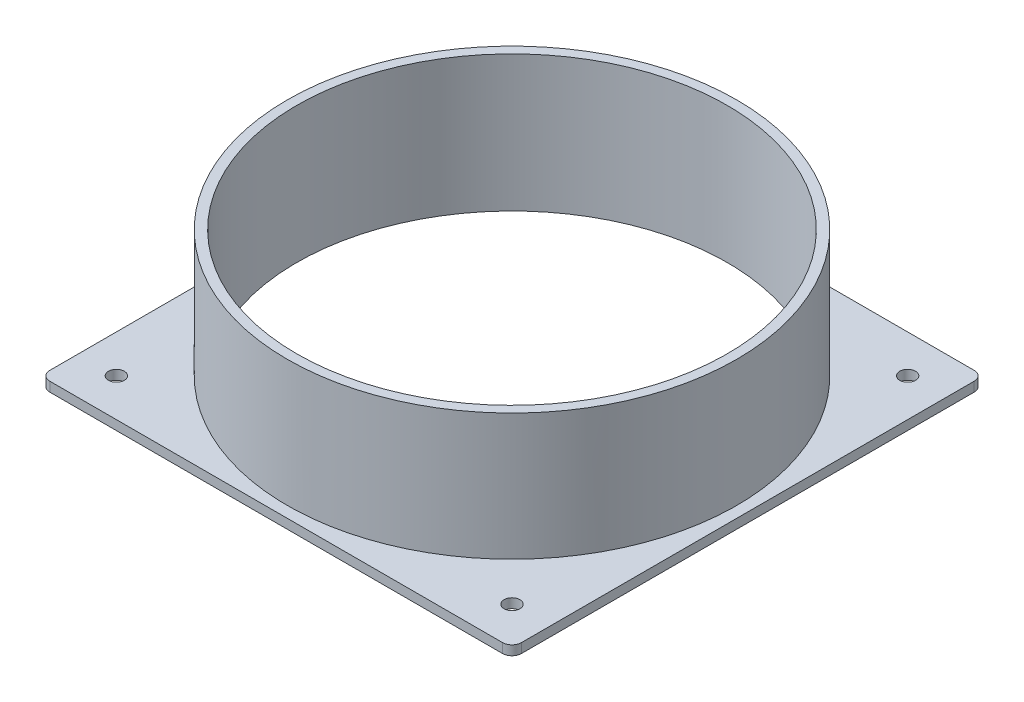
ISO-10303-21;
HEADER;
FILE_DESCRIPTION(('STEP AP214'),'2;1');
FILE_NAME('part.step','',(''),(''),'','','');
FILE_SCHEMA(('AUTOMOTIVE_DESIGN { 1 0 10303 214 1 1 1 1 }'));
ENDSEC;
DATA;
#1=APPLICATION_CONTEXT('core data for automotive mechanical design processes');
#2=APPLICATION_PROTOCOL_DEFINITION('international standard','automotive_design',2000,#1);
#3=PRODUCT_CONTEXT('',#1,'mechanical');
#4=PRODUCT('Part','Part','',(#3));
#5=PRODUCT_RELATED_PRODUCT_CATEGORY('part','',(#4));
#6=PRODUCT_DEFINITION_FORMATION('','',#4);
#7=PRODUCT_DEFINITION_CONTEXT('part definition',#1,'design');
#8=PRODUCT_DEFINITION('design','',#6,#7);
#9=PRODUCT_DEFINITION_SHAPE('','',#8);
#10=(LENGTH_UNIT() NAMED_UNIT(*) SI_UNIT(.MILLI.,.METRE.));
#11=(NAMED_UNIT(*) PLANE_ANGLE_UNIT() SI_UNIT($,.RADIAN.));
#12=(NAMED_UNIT(*) SI_UNIT($,.STERADIAN.) SOLID_ANGLE_UNIT());
#13=UNCERTAINTY_MEASURE_WITH_UNIT(LENGTH_MEASURE(1.E-05),#10,'distance_accuracy_value','');
#14=(GEOMETRIC_REPRESENTATION_CONTEXT(3) GLOBAL_UNCERTAINTY_ASSIGNED_CONTEXT((#13)) GLOBAL_UNIT_ASSIGNED_CONTEXT((#10,
#11,#12)) REPRESENTATION_CONTEXT('',''));
#15=CARTESIAN_POINT('',(0.,0.,0.));
#16=DIRECTION('',(0.,0.,1.));
#17=DIRECTION('',(1.,0.,0.));
#18=AXIS2_PLACEMENT_3D('',#15,#16,#17);
#19=CARTESIAN_POINT('',(-71.5,3.,71.5));
#20=DIRECTION('',(0.,-1.,0.));
#21=DIRECTION('',(0.,0.,-1.));
#22=AXIS2_PLACEMENT_3D('',#19,#20,#21);
#23=PLANE('',#22);
#24=CARTESIAN_POINT('',(-62.5000000000007,3.,62.4999999999994));
#25=DIRECTION('',(0.,1.,0.));
#26=DIRECTION('',(0.,0.,1.));
#27=AXIS2_PLACEMENT_3D('',#24,#25,#26);
#28=CIRCLE('',#27,2.5);
#29=CARTESIAN_POINT('',(-62.5000000000007,3.,64.9999999999993));
#30=VERTEX_POINT('',#29);
#31=EDGE_CURVE('E208',#30,#30,#28,.T.);
#32=ORIENTED_EDGE('',*,*,#31,.F.);
#33=EDGE_LOOP('',(#32));
#34=FACE_BOUND('',#33,.T.);
#35=CARTESIAN_POINT('',(62.4999999999996,3.,62.5000000000004));
#36=DIRECTION('',(0.,1.,0.));
#37=DIRECTION('',(0.,0.,1.));
#38=AXIS2_PLACEMENT_3D('',#35,#36,#37);
#39=CIRCLE('',#38,2.50000000000001);
#40=CARTESIAN_POINT('',(62.4999999999996,3.,65.0000000000004));
#41=VERTEX_POINT('',#40);
#42=EDGE_CURVE('E202',#41,#41,#39,.T.);
#43=ORIENTED_EDGE('',*,*,#42,.F.);
#44=EDGE_LOOP('',(#43));
#45=FACE_BOUND('',#44,.T.);
#46=CARTESIAN_POINT('',(62.5000000000002,3.,-62.4999999999998));
#47=DIRECTION('',(0.,1.,0.));
#48=DIRECTION('',(0.,0.,1.));
#49=AXIS2_PLACEMENT_3D('',#46,#47,#48);
#50=CIRCLE('',#49,2.50000000000001);
#51=CARTESIAN_POINT('',(62.5000000000002,3.,-59.9999999999998));
#52=VERTEX_POINT('',#51);
#53=EDGE_CURVE('E196',#52,#52,#50,.T.);
#54=ORIENTED_EDGE('',*,*,#53,.F.);
#55=EDGE_LOOP('',(#54));
#56=FACE_BOUND('',#55,.T.);
#57=CARTESIAN_POINT('',(-62.5,3.,-62.5));
#58=DIRECTION('',(0.,1.,0.));
#59=DIRECTION('',(0.,0.,1.));
#60=AXIS2_PLACEMENT_3D('',#57,#58,#59);
#61=CIRCLE('',#60,2.5);
#62=CARTESIAN_POINT('',(-62.5,3.,-60.));
#63=VERTEX_POINT('',#62);
#64=EDGE_CURVE('E192',#63,#63,#61,.T.);
#65=ORIENTED_EDGE('',*,*,#64,.F.);
#66=EDGE_LOOP('',(#65));
#67=FACE_BOUND('',#66,.T.);
#68=CARTESIAN_POINT('',(-71.5,3.,71.5));
#69=DIRECTION('',(0.,1.,0.));
#70=DIRECTION('',(0.,0.,-1.));
#71=AXIS2_PLACEMENT_3D('',#68,#69,#70);
#72=CIRCLE('',#71,3.);
#73=CARTESIAN_POINT('',(-74.5,3.,71.5));
#74=VERTEX_POINT('',#73);
#75=CARTESIAN_POINT('',(-71.5,3.,74.5));
#76=VERTEX_POINT('',#75);
#77=EDGE_CURVE('E152',#74,#76,#72,.T.);
#78=ORIENTED_EDGE('',*,*,#77,.T.);
#79=DIRECTION('',(1.,0.,0.));
#80=VECTOR('',#79,1.);
#81=CARTESIAN_POINT('',(-71.5,3.,74.5));
#82=LINE('',#81,#80);
#83=CARTESIAN_POINT('',(71.5,3.,74.5));
#84=VERTEX_POINT('',#83);
#85=EDGE_CURVE('E100',#76,#84,#82,.T.);
#86=ORIENTED_EDGE('',*,*,#85,.T.);
#87=CARTESIAN_POINT('',(71.5,3.,71.5));
#88=DIRECTION('',(0.,1.,0.));
#89=DIRECTION('',(0.,0.,1.));
#90=AXIS2_PLACEMENT_3D('',#87,#88,#89);
#91=CIRCLE('',#90,3.);
#92=CARTESIAN_POINT('',(74.5,3.,71.5));
#93=VERTEX_POINT('',#92);
#94=EDGE_CURVE('E184',#84,#93,#91,.T.);
#95=ORIENTED_EDGE('',*,*,#94,.T.);
#96=DIRECTION('',(0.,0.,-1.));
#97=VECTOR('',#96,1.);
#98=CARTESIAN_POINT('',(74.5,3.,-71.5));
#99=LINE('',#98,#97);
#100=CARTESIAN_POINT('',(74.5,3.,-71.5));
#101=VERTEX_POINT('',#100);
#102=EDGE_CURVE('E183',#93,#101,#99,.T.);
#103=ORIENTED_EDGE('',*,*,#102,.T.);
#104=CARTESIAN_POINT('',(71.5,3.,-71.5));
#105=DIRECTION('',(0.,1.,0.));
#106=DIRECTION('',(0.,0.,1.));
#107=AXIS2_PLACEMENT_3D('',#104,#105,#106);
#108=CIRCLE('',#107,3.);
#109=CARTESIAN_POINT('',(71.5,3.,-74.5));
#110=VERTEX_POINT('',#109);
#111=EDGE_CURVE('E119',#101,#110,#108,.T.);
#112=ORIENTED_EDGE('',*,*,#111,.T.);
#113=DIRECTION('',(-1.,0.,0.));
#114=VECTOR('',#113,1.);
#115=CARTESIAN_POINT('',(-71.5,3.,-74.5));
#116=LINE('',#115,#114);
#117=CARTESIAN_POINT('',(-71.5,3.,-74.5));
#118=VERTEX_POINT('',#117);
#119=EDGE_CURVE('E113',#110,#118,#116,.T.);
#120=ORIENTED_EDGE('',*,*,#119,.T.);
#121=CARTESIAN_POINT('',(-71.5,3.,-71.5));
#122=DIRECTION('',(0.,1.,0.));
#123=DIRECTION('',(0.,0.,1.));
#124=AXIS2_PLACEMENT_3D('',#121,#122,#123);
#125=CIRCLE('',#124,3.);
#126=CARTESIAN_POINT('',(-74.5,3.,-71.5));
#127=VERTEX_POINT('',#126);
#128=EDGE_CURVE('E117',#118,#127,#125,.T.);
#129=ORIENTED_EDGE('',*,*,#128,.T.);
#130=DIRECTION('',(0.,0.,1.));
#131=VECTOR('',#130,1.);
#132=CARTESIAN_POINT('',(-74.5,3.,-71.5));
#133=LINE('',#132,#131);
#134=EDGE_CURVE('E56',#127,#74,#133,.T.);
#135=ORIENTED_EDGE('',*,*,#134,.T.);
#136=EDGE_LOOP('',(#78,#86,#95,#103,#112,#120,#129,#135));
#137=FACE_BOUND('',#136,.T.);
#138=CARTESIAN_POINT('',(0.,3.,0.));
#139=DIRECTION('',(0.,-1.,0.));
#140=DIRECTION('',(0.,0.,-1.));
#141=AXIS2_PLACEMENT_3D('',#138,#139,#140);
#142=CIRCLE('',#141,71.);
#143=CARTESIAN_POINT('',(0.,3.,-71.));
#144=VERTEX_POINT('',#143);
#145=EDGE_CURVE('E11',#144,#144,#142,.F.);
#146=ORIENTED_EDGE('',*,*,#145,.F.);
#147=EDGE_LOOP('',(#146));
#148=FACE_BOUND('',#147,.T.);
#149=ADVANCED_FACE('F39',(#34,#45,#56,#67,#137,#148),#23,.F.);
#150=CARTESIAN_POINT('',(-71.5,0.,71.5));
#151=DIRECTION('',(0.,-1.,0.));
#152=DIRECTION('',(0.,0.,-1.));
#153=AXIS2_PLACEMENT_3D('',#150,#151,#152);
#154=PLANE('',#153);
#155=CARTESIAN_POINT('',(62.4999999999996,0.,62.5000000000004));
#156=DIRECTION('',(0.,1.,0.));
#157=DIRECTION('',(0.,0.,1.));
#158=AXIS2_PLACEMENT_3D('',#155,#156,#157);
#159=CIRCLE('',#158,2.50000000000001);
#160=CARTESIAN_POINT('',(62.4999999999996,0.,65.0000000000004));
#161=VERTEX_POINT('',#160);
#162=EDGE_CURVE('E205',#161,#161,#159,.T.);
#163=ORIENTED_EDGE('',*,*,#162,.T.);
#164=EDGE_LOOP('',(#163));
#165=FACE_BOUND('',#164,.T.);
#166=CARTESIAN_POINT('',(-62.5,0.,-62.5));
#167=DIRECTION('',(0.,1.,0.));
#168=DIRECTION('',(0.,0.,1.));
#169=AXIS2_PLACEMENT_3D('',#166,#167,#168);
#170=CIRCLE('',#169,2.5);
#171=CARTESIAN_POINT('',(-62.5,0.,-60.));
#172=VERTEX_POINT('',#171);
#173=EDGE_CURVE('E193',#172,#172,#170,.T.);
#174=ORIENTED_EDGE('',*,*,#173,.T.);
#175=EDGE_LOOP('',(#174));
#176=FACE_BOUND('',#175,.T.);
#177=CARTESIAN_POINT('',(-71.5,0.,71.5));
#178=DIRECTION('',(0.,1.,0.));
#179=DIRECTION('',(0.,0.,-1.));
#180=AXIS2_PLACEMENT_3D('',#177,#178,#179);
#181=CIRCLE('',#180,3.);
#182=CARTESIAN_POINT('',(-74.5,0.,71.5));
#183=VERTEX_POINT('',#182);
#184=CARTESIAN_POINT('',(-71.5,0.,74.5));
#185=VERTEX_POINT('',#184);
#186=EDGE_CURVE('E137',#183,#185,#181,.T.);
#187=ORIENTED_EDGE('',*,*,#186,.F.);
#188=DIRECTION('',(0.,0.,1.));
#189=VECTOR('',#188,1.);
#190=CARTESIAN_POINT('',(-74.5,0.,-71.5));
#191=LINE('',#190,#189);
#192=CARTESIAN_POINT('',(-74.5,0.,-71.5));
#193=VERTEX_POINT('',#192);
#194=EDGE_CURVE('E91',#193,#183,#191,.T.);
#195=ORIENTED_EDGE('',*,*,#194,.F.);
#196=CARTESIAN_POINT('',(-71.5,0.,-71.5));
#197=DIRECTION('',(0.,1.,0.));
#198=DIRECTION('',(0.,0.,1.));
#199=AXIS2_PLACEMENT_3D('',#196,#197,#198);
#200=CIRCLE('',#199,3.);
#201=CARTESIAN_POINT('',(-71.5,0.,-74.5));
#202=VERTEX_POINT('',#201);
#203=EDGE_CURVE('E85',#202,#193,#200,.T.);
#204=ORIENTED_EDGE('',*,*,#203,.F.);
#205=DIRECTION('',(-1.,0.,0.));
#206=VECTOR('',#205,1.);
#207=CARTESIAN_POINT('',(-71.5,0.,-74.5));
#208=LINE('',#207,#206);
#209=CARTESIAN_POINT('',(71.5,0.,-74.5));
#210=VERTEX_POINT('',#209);
#211=EDGE_CURVE('E127',#210,#202,#208,.T.);
#212=ORIENTED_EDGE('',*,*,#211,.F.);
#213=CARTESIAN_POINT('',(71.5,0.,-71.5));
#214=DIRECTION('',(0.,1.,0.));
#215=DIRECTION('',(0.,0.,1.));
#216=AXIS2_PLACEMENT_3D('',#213,#214,#215);
#217=CIRCLE('',#216,3.);
#218=CARTESIAN_POINT('',(74.5,0.,-71.5));
#219=VERTEX_POINT('',#218);
#220=EDGE_CURVE('E147',#219,#210,#217,.T.);
#221=ORIENTED_EDGE('',*,*,#220,.F.);
#222=DIRECTION('',(0.,0.,-1.));
#223=VECTOR('',#222,1.);
#224=CARTESIAN_POINT('',(74.5,0.,-71.5));
#225=LINE('',#224,#223);
#226=CARTESIAN_POINT('',(74.5,0.,71.5));
#227=VERTEX_POINT('',#226);
#228=EDGE_CURVE('E145',#227,#219,#225,.T.);
#229=ORIENTED_EDGE('',*,*,#228,.F.);
#230=CARTESIAN_POINT('',(71.5,0.,71.5));
#231=DIRECTION('',(0.,1.,0.));
#232=DIRECTION('',(0.,0.,1.));
#233=AXIS2_PLACEMENT_3D('',#230,#231,#232);
#234=CIRCLE('',#233,3.);
#235=CARTESIAN_POINT('',(71.5,0.,74.5));
#236=VERTEX_POINT('',#235);
#237=EDGE_CURVE('E143',#236,#227,#234,.T.);
#238=ORIENTED_EDGE('',*,*,#237,.F.);
#239=DIRECTION('',(1.,0.,0.));
#240=VECTOR('',#239,1.);
#241=CARTESIAN_POINT('',(-71.5,0.,74.5));
#242=LINE('',#241,#240);
#243=EDGE_CURVE('E140',#185,#236,#242,.T.);
#244=ORIENTED_EDGE('',*,*,#243,.F.);
#245=EDGE_LOOP('',(#187,#195,#204,#212,#221,#229,#238,#244));
#246=FACE_BOUND('',#245,.T.);
#247=CARTESIAN_POINT('',(0.,0.,0.));
#248=DIRECTION('',(0.,1.,0.));
#249=DIRECTION('',(0.,0.,1.));
#250=AXIS2_PLACEMENT_3D('',#247,#248,#249);
#251=CIRCLE('',#250,68.);
#252=CARTESIAN_POINT('',(0.,0.,68.));
#253=VERTEX_POINT('',#252);
#254=EDGE_CURVE('E141',#253,#253,#251,.T.);
#255=ORIENTED_EDGE('',*,*,#254,.T.);
#256=EDGE_LOOP('',(#255));
#257=FACE_BOUND('',#256,.T.);
#258=CARTESIAN_POINT('',(62.5000000000002,0.,-62.4999999999998));
#259=DIRECTION('',(0.,1.,0.));
#260=DIRECTION('',(0.,0.,1.));
#261=AXIS2_PLACEMENT_3D('',#258,#259,#260);
#262=CIRCLE('',#261,2.50000000000001);
#263=CARTESIAN_POINT('',(62.5000000000002,0.,-59.9999999999998));
#264=VERTEX_POINT('',#263);
#265=EDGE_CURVE('E199',#264,#264,#262,.T.);
#266=ORIENTED_EDGE('',*,*,#265,.T.);
#267=EDGE_LOOP('',(#266));
#268=FACE_BOUND('',#267,.T.);
#269=CARTESIAN_POINT('',(-62.5000000000007,0.,62.4999999999994));
#270=DIRECTION('',(0.,1.,0.));
#271=DIRECTION('',(0.,0.,1.));
#272=AXIS2_PLACEMENT_3D('',#269,#270,#271);
#273=CIRCLE('',#272,2.5);
#274=CARTESIAN_POINT('',(-62.5000000000007,0.,64.9999999999993));
#275=VERTEX_POINT('',#274);
#276=EDGE_CURVE('E211',#275,#275,#273,.T.);
#277=ORIENTED_EDGE('',*,*,#276,.T.);
#278=EDGE_LOOP('',(#277));
#279=FACE_BOUND('',#278,.T.);
#280=ADVANCED_FACE('F170',(#165,#176,#246,#257,#268,#279),#154,.T.);
#281=CARTESIAN_POINT('',(-71.5,3.,71.5));
#282=DIRECTION('',(0.,-1.,0.));
#283=DIRECTION('',(0.,0.,-1.));
#284=AXIS2_PLACEMENT_3D('',#281,#282,#283);
#285=CYLINDRICAL_SURFACE('',#284,3.);
#286=ORIENTED_EDGE('',*,*,#186,.T.);
#287=DIRECTION('',(0.,-1.,0.));
#288=VECTOR('',#287,1.);
#289=CARTESIAN_POINT('',(-71.5,3.,74.5));
#290=LINE('',#289,#288);
#291=EDGE_CURVE('E48',#76,#185,#290,.T.);
#292=ORIENTED_EDGE('',*,*,#291,.F.);
#293=ORIENTED_EDGE('',*,*,#77,.F.);
#294=DIRECTION('',(0.,-1.,0.));
#295=VECTOR('',#294,1.);
#296=CARTESIAN_POINT('',(-74.5,3.,71.5));
#297=LINE('',#296,#295);
#298=EDGE_CURVE('E133',#74,#183,#297,.T.);
#299=ORIENTED_EDGE('',*,*,#298,.T.);
#300=EDGE_LOOP('',(#286,#292,#293,#299));
#301=FACE_BOUND('',#300,.T.);
#302=ADVANCED_FACE('F41',(#301),#285,.T.);
#303=CARTESIAN_POINT('',(-71.5,3.,74.5));
#304=DIRECTION('',(0.,0.,-1.));
#305=DIRECTION('',(-1.,0.,0.));
#306=AXIS2_PLACEMENT_3D('',#303,#304,#305);
#307=PLANE('',#306);
#308=ORIENTED_EDGE('',*,*,#243,.T.);
#309=DIRECTION('',(0.,-1.,0.));
#310=VECTOR('',#309,1.);
#311=CARTESIAN_POINT('',(71.5,3.,74.5));
#312=LINE('',#311,#310);
#313=EDGE_CURVE('E162',#84,#236,#312,.T.);
#314=ORIENTED_EDGE('',*,*,#313,.F.);
#315=ORIENTED_EDGE('',*,*,#85,.F.);
#316=ORIENTED_EDGE('',*,*,#291,.T.);
#317=EDGE_LOOP('',(#308,#314,#315,#316));
#318=FACE_BOUND('',#317,.T.);
#319=ADVANCED_FACE('F165',(#318),#307,.F.);
#320=CARTESIAN_POINT('',(71.5,3.,71.5));
#321=DIRECTION('',(0.,-1.,0.));
#322=DIRECTION('',(0.,0.,-1.));
#323=AXIS2_PLACEMENT_3D('',#320,#321,#322);
#324=CYLINDRICAL_SURFACE('',#323,3.);
#325=ORIENTED_EDGE('',*,*,#237,.T.);
#326=DIRECTION('',(0.,-1.,0.));
#327=VECTOR('',#326,1.);
#328=CARTESIAN_POINT('',(74.5,3.,71.5));
#329=LINE('',#328,#327);
#330=EDGE_CURVE('E159',#93,#227,#329,.T.);
#331=ORIENTED_EDGE('',*,*,#330,.F.);
#332=ORIENTED_EDGE('',*,*,#94,.F.);
#333=ORIENTED_EDGE('',*,*,#313,.T.);
#334=EDGE_LOOP('',(#325,#331,#332,#333));
#335=FACE_BOUND('',#334,.T.);
#336=ADVANCED_FACE('F177',(#335),#324,.T.);
#337=CARTESIAN_POINT('',(74.5,3.,-71.5));
#338=DIRECTION('',(-1.,0.,0.));
#339=DIRECTION('',(0.,0.,1.));
#340=AXIS2_PLACEMENT_3D('',#337,#338,#339);
#341=PLANE('',#340);
#342=ORIENTED_EDGE('',*,*,#228,.T.);
#343=DIRECTION('',(0.,-1.,0.));
#344=VECTOR('',#343,1.);
#345=CARTESIAN_POINT('',(74.5,3.,-71.5));
#346=LINE('',#345,#344);
#347=EDGE_CURVE('E156',#101,#219,#346,.T.);
#348=ORIENTED_EDGE('',*,*,#347,.F.);
#349=ORIENTED_EDGE('',*,*,#102,.F.);
#350=ORIENTED_EDGE('',*,*,#330,.T.);
#351=EDGE_LOOP('',(#342,#348,#349,#350));
#352=FACE_BOUND('',#351,.T.);
#353=ADVANCED_FACE('F181',(#352),#341,.F.);
#354=CARTESIAN_POINT('',(71.5,3.,-71.5));
#355=DIRECTION('',(0.,-1.,0.));
#356=DIRECTION('',(0.,0.,-1.));
#357=AXIS2_PLACEMENT_3D('',#354,#355,#356);
#358=CYLINDRICAL_SURFACE('',#357,3.);
#359=ORIENTED_EDGE('',*,*,#220,.T.);
#360=DIRECTION('',(0.,-1.,0.));
#361=VECTOR('',#360,1.);
#362=CARTESIAN_POINT('',(71.5,3.,-74.5));
#363=LINE('',#362,#361);
#364=EDGE_CURVE('E128',#110,#210,#363,.T.);
#365=ORIENTED_EDGE('',*,*,#364,.F.);
#366=ORIENTED_EDGE('',*,*,#111,.F.);
#367=ORIENTED_EDGE('',*,*,#347,.T.);
#368=EDGE_LOOP('',(#359,#365,#366,#367));
#369=FACE_BOUND('',#368,.T.);
#370=ADVANCED_FACE('F261',(#369),#358,.T.);
#371=CARTESIAN_POINT('',(-71.5,3.,-74.5));
#372=DIRECTION('',(0.,0.,1.));
#373=DIRECTION('',(1.,0.,0.));
#374=AXIS2_PLACEMENT_3D('',#371,#372,#373);
#375=PLANE('',#374);
#376=ORIENTED_EDGE('',*,*,#211,.T.);
#377=DIRECTION('',(0.,-1.,0.));
#378=VECTOR('',#377,1.);
#379=CARTESIAN_POINT('',(-71.5,3.,-74.5));
#380=LINE('',#379,#378);
#381=EDGE_CURVE('E124',#118,#202,#380,.T.);
#382=ORIENTED_EDGE('',*,*,#381,.F.);
#383=ORIENTED_EDGE('',*,*,#119,.F.);
#384=ORIENTED_EDGE('',*,*,#364,.T.);
#385=EDGE_LOOP('',(#376,#382,#383,#384));
#386=FACE_BOUND('',#385,.T.);
#387=ADVANCED_FACE('F125',(#386),#375,.F.);
#388=CARTESIAN_POINT('',(-71.5,3.,-71.5));
#389=DIRECTION('',(0.,-1.,0.));
#390=DIRECTION('',(0.,0.,-1.));
#391=AXIS2_PLACEMENT_3D('',#388,#389,#390);
#392=CYLINDRICAL_SURFACE('',#391,3.);
#393=ORIENTED_EDGE('',*,*,#203,.T.);
#394=DIRECTION('',(0.,-1.,0.));
#395=VECTOR('',#394,1.);
#396=CARTESIAN_POINT('',(-74.5,3.,-71.5));
#397=LINE('',#396,#395);
#398=EDGE_CURVE('E129',#127,#193,#397,.T.);
#399=ORIENTED_EDGE('',*,*,#398,.F.);
#400=ORIENTED_EDGE('',*,*,#128,.F.);
#401=ORIENTED_EDGE('',*,*,#381,.T.);
#402=EDGE_LOOP('',(#393,#399,#400,#401));
#403=FACE_BOUND('',#402,.T.);
#404=ADVANCED_FACE('F131',(#403),#392,.T.);
#405=CARTESIAN_POINT('',(-74.5,3.,-71.5));
#406=DIRECTION('',(1.,0.,0.));
#407=DIRECTION('',(0.,0.,-1.));
#408=AXIS2_PLACEMENT_3D('',#405,#406,#407);
#409=PLANE('',#408);
#410=ORIENTED_EDGE('',*,*,#194,.T.);
#411=ORIENTED_EDGE('',*,*,#298,.F.);
#412=ORIENTED_EDGE('',*,*,#134,.F.);
#413=ORIENTED_EDGE('',*,*,#398,.T.);
#414=EDGE_LOOP('',(#410,#411,#412,#413));
#415=FACE_BOUND('',#414,.T.);
#416=ADVANCED_FACE('F254',(#415),#409,.F.);
#417=CARTESIAN_POINT('',(0.,3.,0.));
#418=DIRECTION('',(0.,-1.,0.));
#419=DIRECTION('',(0.,0.,-1.));
#420=AXIS2_PLACEMENT_3D('',#417,#418,#419);
#421=CYLINDRICAL_SURFACE('',#420,68.);
#422=ORIENTED_EDGE('',*,*,#254,.F.);
#423=EDGE_LOOP('',(#422));
#424=FACE_BOUND('',#423,.T.);
#425=CARTESIAN_POINT('',(0.,43.,0.));
#426=DIRECTION('',(0.,1.,0.));
#427=DIRECTION('',(0.,0.,1.));
#428=AXIS2_PLACEMENT_3D('',#425,#426,#427);
#429=CIRCLE('',#428,68.);
#430=CARTESIAN_POINT('',(0.,43.,68.));
#431=VERTEX_POINT('',#430);
#432=EDGE_CURVE('E219',#431,#431,#429,.T.);
#433=ORIENTED_EDGE('',*,*,#432,.T.);
#434=EDGE_LOOP('',(#433));
#435=FACE_BOUND('',#434,.T.);
#436=ADVANCED_FACE('F223',(#424,#435),#421,.F.);
#437=CARTESIAN_POINT('',(-62.5,3.,-62.5));
#438=DIRECTION('',(0.,-1.,0.));
#439=DIRECTION('',(0.,0.,-1.));
#440=AXIS2_PLACEMENT_3D('',#437,#438,#439);
#441=CYLINDRICAL_SURFACE('',#440,2.5);
#442=ORIENTED_EDGE('',*,*,#64,.T.);
#443=EDGE_LOOP('',(#442));
#444=FACE_BOUND('',#443,.T.);
#445=ORIENTED_EDGE('',*,*,#173,.F.);
#446=EDGE_LOOP('',(#445));
#447=FACE_BOUND('',#446,.T.);
#448=ADVANCED_FACE('F322',(#444,#447),#441,.F.);
#449=CARTESIAN_POINT('',(62.5000000000002,3.,-62.4999999999998));
#450=DIRECTION('',(0.,-1.,0.));
#451=DIRECTION('',(0.,0.,-1.));
#452=AXIS2_PLACEMENT_3D('',#449,#450,#451);
#453=CYLINDRICAL_SURFACE('',#452,2.50000000000001);
#454=ORIENTED_EDGE('',*,*,#53,.T.);
#455=EDGE_LOOP('',(#454));
#456=FACE_BOUND('',#455,.T.);
#457=ORIENTED_EDGE('',*,*,#265,.F.);
#458=EDGE_LOOP('',(#457));
#459=FACE_BOUND('',#458,.T.);
#460=ADVANCED_FACE('F331',(#456,#459),#453,.F.);
#461=CARTESIAN_POINT('',(62.4999999999996,3.,62.5000000000004));
#462=DIRECTION('',(0.,-1.,0.));
#463=DIRECTION('',(0.,0.,-1.));
#464=AXIS2_PLACEMENT_3D('',#461,#462,#463);
#465=CYLINDRICAL_SURFACE('',#464,2.50000000000001);
#466=ORIENTED_EDGE('',*,*,#42,.T.);
#467=EDGE_LOOP('',(#466));
#468=FACE_BOUND('',#467,.T.);
#469=ORIENTED_EDGE('',*,*,#162,.F.);
#470=EDGE_LOOP('',(#469));
#471=FACE_BOUND('',#470,.T.);
#472=ADVANCED_FACE('F238',(#468,#471),#465,.F.);
#473=CARTESIAN_POINT('',(-62.5000000000007,3.,62.4999999999994));
#474=DIRECTION('',(0.,-1.,0.));
#475=DIRECTION('',(0.,0.,-1.));
#476=AXIS2_PLACEMENT_3D('',#473,#474,#475);
#477=CYLINDRICAL_SURFACE('',#476,2.5);
#478=ORIENTED_EDGE('',*,*,#31,.T.);
#479=EDGE_LOOP('',(#478));
#480=FACE_BOUND('',#479,.T.);
#481=ORIENTED_EDGE('',*,*,#276,.F.);
#482=EDGE_LOOP('',(#481));
#483=FACE_BOUND('',#482,.T.);
#484=ADVANCED_FACE('F228',(#480,#483),#477,.F.);
#485=CARTESIAN_POINT('',(0.,43.,0.));
#486=DIRECTION('',(0.,1.,0.));
#487=DIRECTION('',(0.,0.,1.));
#488=AXIS2_PLACEMENT_3D('',#485,#486,#487);
#489=PLANE('',#488);
#490=CARTESIAN_POINT('',(0.,43.,0.));
#491=DIRECTION('',(0.,1.,0.));
#492=DIRECTION('',(0.,0.,1.));
#493=AXIS2_PLACEMENT_3D('',#490,#491,#492);
#494=CIRCLE('',#493,71.);
#495=CARTESIAN_POINT('',(0.,43.,71.));
#496=VERTEX_POINT('',#495);
#497=EDGE_CURVE('E214',#496,#496,#494,.T.);
#498=ORIENTED_EDGE('',*,*,#497,.T.);
#499=EDGE_LOOP('',(#498));
#500=FACE_BOUND('',#499,.T.);
#501=ORIENTED_EDGE('',*,*,#432,.F.);
#502=EDGE_LOOP('',(#501));
#503=FACE_BOUND('',#502,.T.);
#504=ADVANCED_FACE('F225',(#500,#503),#489,.T.);
#505=CARTESIAN_POINT('',(0.,43.,0.));
#506=DIRECTION('',(0.,-1.,0.));
#507=DIRECTION('',(0.,0.,-1.));
#508=AXIS2_PLACEMENT_3D('',#505,#506,#507);
#509=CYLINDRICAL_SURFACE('',#508,71.);
#510=ORIENTED_EDGE('',*,*,#497,.F.);
#511=EDGE_LOOP('',(#510));
#512=FACE_BOUND('',#511,.T.);
#513=ORIENTED_EDGE('',*,*,#145,.T.);
#514=EDGE_LOOP('',(#513));
#515=FACE_BOUND('',#514,.T.);
#516=ADVANCED_FACE('F227',(#512,#515),#509,.T.);
#517=CLOSED_SHELL('',(#149,#280,#302,#319,#336,#353,#370,#387,#404,#416,#436,#448,#460,#472,
#484,#504,#516));
#518=MANIFOLD_SOLID_BREP('B2',#517);
#519=ADVANCED_BREP_SHAPE_REPRESENTATION('',(#18,#518),#14);
#520=SHAPE_DEFINITION_REPRESENTATION(#9,#519);
ENDSEC;
END-ISO-10303-21;
